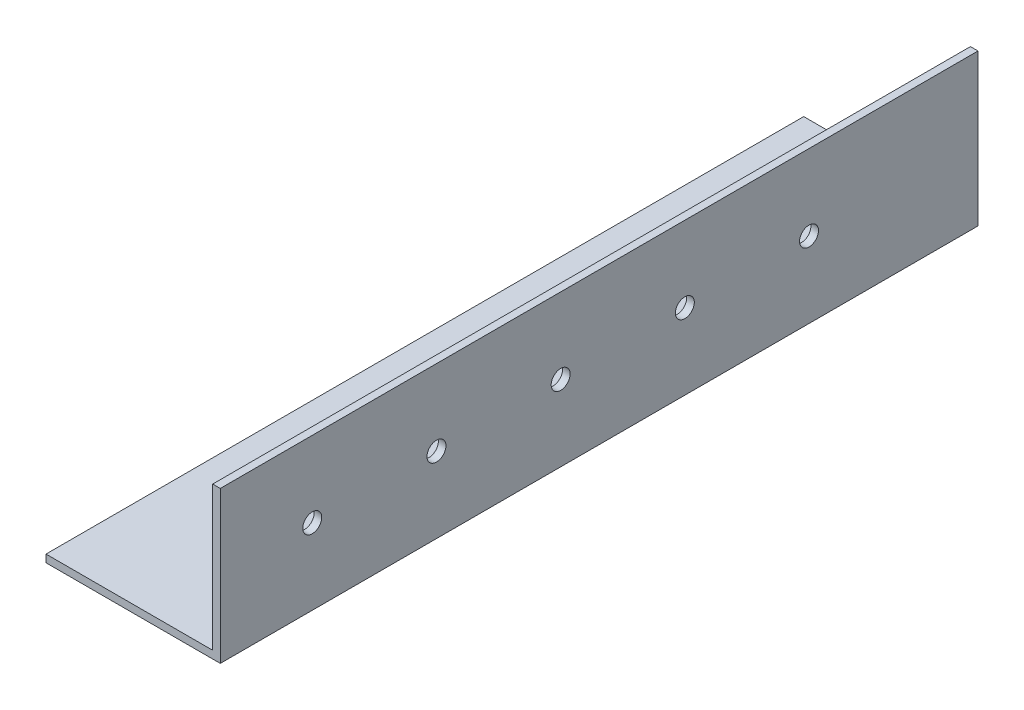
ISO-10303-21;
HEADER;
FILE_DESCRIPTION(('STEP AP214'),'2;1');
FILE_NAME('part.step','',(''),(''),'','','');
FILE_SCHEMA(('AUTOMOTIVE_DESIGN { 1 0 10303 214 1 1 1 1 }'));
ENDSEC;
DATA;
#1=APPLICATION_CONTEXT('core data for automotive mechanical design processes');
#2=APPLICATION_PROTOCOL_DEFINITION('international standard','automotive_design',2000,#1);
#3=PRODUCT_CONTEXT('',#1,'mechanical');
#4=PRODUCT('Part','Part','',(#3));
#5=PRODUCT_RELATED_PRODUCT_CATEGORY('part','',(#4));
#6=PRODUCT_DEFINITION_FORMATION('','',#4);
#7=PRODUCT_DEFINITION_CONTEXT('part definition',#1,'design');
#8=PRODUCT_DEFINITION('design','',#6,#7);
#9=PRODUCT_DEFINITION_SHAPE('','',#8);
#10=(LENGTH_UNIT() NAMED_UNIT(*) SI_UNIT(.MILLI.,.METRE.));
#11=(NAMED_UNIT(*) PLANE_ANGLE_UNIT() SI_UNIT($,.RADIAN.));
#12=(NAMED_UNIT(*) SI_UNIT($,.STERADIAN.) SOLID_ANGLE_UNIT());
#13=UNCERTAINTY_MEASURE_WITH_UNIT(LENGTH_MEASURE(1.E-05),#10,'distance_accuracy_value','');
#14=(GEOMETRIC_REPRESENTATION_CONTEXT(3) GLOBAL_UNCERTAINTY_ASSIGNED_CONTEXT((#13)) GLOBAL_UNIT_ASSIGNED_CONTEXT((#10,
#11,#12)) REPRESENTATION_CONTEXT('',''));
#15=CARTESIAN_POINT('',(0.,0.,0.));
#16=DIRECTION('',(0.,0.,1.));
#17=DIRECTION('',(1.,0.,0.));
#18=AXIS2_PLACEMENT_3D('',#15,#16,#17);
#19=CARTESIAN_POINT('',(0.,0.,100.));
#20=DIRECTION('',(0.,0.,-1.));
#21=DIRECTION('',(1.,0.,0.));
#22=AXIS2_PLACEMENT_3D('',#19,#20,#21);
#23=PLANE('',#22);
#24=DIRECTION('',(1.,0.,0.));
#25=VECTOR('',#24,1.);
#26=CARTESIAN_POINT('',(0.,-20.,100.));
#27=LINE('',#26,#25);
#28=CARTESIAN_POINT('',(-19.,-20.,100.));
#29=VERTEX_POINT('',#28);
#30=CARTESIAN_POINT('',(27.,-20.,100.));
#31=VERTEX_POINT('',#30);
#32=EDGE_CURVE('E110',#29,#31,#27,.T.);
#33=ORIENTED_EDGE('',*,*,#32,.T.);
#34=DIRECTION('',(0.,-1.,0.));
#35=VECTOR('',#34,1.);
#36=CARTESIAN_POINT('',(27.,20.,100.));
#37=LINE('',#36,#35);
#38=CARTESIAN_POINT('',(27.,20.,100.));
#39=VERTEX_POINT('',#38);
#40=EDGE_CURVE('E125',#39,#31,#37,.T.);
#41=ORIENTED_EDGE('',*,*,#40,.F.);
#42=DIRECTION('',(1.,0.,0.));
#43=VECTOR('',#42,1.);
#44=CARTESIAN_POINT('',(25.,20.,100.));
#45=LINE('',#44,#43);
#46=CARTESIAN_POINT('',(25.,20.,100.));
#47=VERTEX_POINT('',#46);
#48=EDGE_CURVE('E132',#47,#39,#45,.T.);
#49=ORIENTED_EDGE('',*,*,#48,.F.);
#50=DIRECTION('',(0.,1.,0.));
#51=VECTOR('',#50,1.);
#52=CARTESIAN_POINT('',(25.,-18.,100.));
#53=LINE('',#52,#51);
#54=CARTESIAN_POINT('',(25.,-18.,100.));
#55=VERTEX_POINT('',#54);
#56=EDGE_CURVE('E130',#55,#47,#53,.T.);
#57=ORIENTED_EDGE('',*,*,#56,.F.);
#58=DIRECTION('',(-1.,0.,0.));
#59=VECTOR('',#58,1.);
#60=CARTESIAN_POINT('',(0.,-18.,100.));
#61=LINE('',#60,#59);
#62=CARTESIAN_POINT('',(-19.,-18.,100.));
#63=VERTEX_POINT('',#62);
#64=EDGE_CURVE('E112',#55,#63,#61,.T.);
#65=ORIENTED_EDGE('',*,*,#64,.T.);
#66=DIRECTION('',(0.,1.,0.));
#67=VECTOR('',#66,1.);
#68=CARTESIAN_POINT('',(-19.,-20.,100.));
#69=LINE('',#68,#67);
#70=EDGE_CURVE('E99',#29,#63,#69,.T.);
#71=ORIENTED_EDGE('',*,*,#70,.F.);
#72=EDGE_LOOP('',(#33,#41,#49,#57,#65,#71));
#73=FACE_BOUND('',#72,.T.);
#74=ADVANCED_FACE('F37',(#73),#23,.F.);
#75=CARTESIAN_POINT('',(0.,-20.,-100.));
#76=DIRECTION('',(0.,1.,0.));
#77=DIRECTION('',(-1.,0.,0.));
#78=AXIS2_PLACEMENT_3D('',#75,#76,#77);
#79=PLANE('',#78);
#80=DIRECTION('',(1.,0.,0.));
#81=VECTOR('',#80,1.);
#82=CARTESIAN_POINT('',(0.,-20.,-100.));
#83=LINE('',#82,#81);
#84=CARTESIAN_POINT('',(-19.,-20.,-100.));
#85=VERTEX_POINT('',#84);
#86=CARTESIAN_POINT('',(27.,-20.,-100.));
#87=VERTEX_POINT('',#86);
#88=EDGE_CURVE('E46',#85,#87,#83,.T.);
#89=ORIENTED_EDGE('',*,*,#88,.T.);
#90=DIRECTION('',(0.,0.,1.));
#91=VECTOR('',#90,1.);
#92=CARTESIAN_POINT('',(27.,-20.,-100.));
#93=LINE('',#92,#91);
#94=EDGE_CURVE('E116',#87,#31,#93,.T.);
#95=ORIENTED_EDGE('',*,*,#94,.T.);
#96=ORIENTED_EDGE('',*,*,#32,.F.);
#97=DIRECTION('',(0.,0.,-1.));
#98=VECTOR('',#97,1.);
#99=CARTESIAN_POINT('',(-19.,-20.,100.));
#100=LINE('',#99,#98);
#101=EDGE_CURVE('E96',#29,#85,#100,.T.);
#102=ORIENTED_EDGE('',*,*,#101,.T.);
#103=EDGE_LOOP('',(#89,#95,#96,#102));
#104=FACE_BOUND('',#103,.T.);
#105=ADVANCED_FACE('F114',(#104),#79,.F.);
#106=CARTESIAN_POINT('',(0.,-18.,-100.));
#107=DIRECTION('',(0.,-1.,0.));
#108=DIRECTION('',(1.,0.,0.));
#109=AXIS2_PLACEMENT_3D('',#106,#107,#108);
#110=PLANE('',#109);
#111=ORIENTED_EDGE('',*,*,#64,.F.);
#112=DIRECTION('',(0.,0.,1.));
#113=VECTOR('',#112,1.);
#114=CARTESIAN_POINT('',(25.,-18.,-100.));
#115=LINE('',#114,#113);
#116=CARTESIAN_POINT('',(25.,-18.,-100.));
#117=VERTEX_POINT('',#116);
#118=EDGE_CURVE('E83',#117,#55,#115,.T.);
#119=ORIENTED_EDGE('',*,*,#118,.F.);
#120=DIRECTION('',(-1.,0.,0.));
#121=VECTOR('',#120,1.);
#122=CARTESIAN_POINT('',(0.,-18.,-100.));
#123=LINE('',#122,#121);
#124=CARTESIAN_POINT('',(-19.,-18.,-100.));
#125=VERTEX_POINT('',#124);
#126=EDGE_CURVE('E11',#117,#125,#123,.T.);
#127=ORIENTED_EDGE('',*,*,#126,.T.);
#128=DIRECTION('',(0.,0.,-1.));
#129=VECTOR('',#128,1.);
#130=CARTESIAN_POINT('',(-19.,-18.,-100.));
#131=LINE('',#130,#129);
#132=EDGE_CURVE('E105',#63,#125,#131,.T.);
#133=ORIENTED_EDGE('',*,*,#132,.F.);
#134=EDGE_LOOP('',(#111,#119,#127,#133));
#135=FACE_BOUND('',#134,.T.);
#136=ADVANCED_FACE('F201',(#135),#110,.F.);
#137=CARTESIAN_POINT('',(0.,0.,-100.));
#138=DIRECTION('',(0.,0.,-1.));
#139=DIRECTION('',(1.,0.,0.));
#140=AXIS2_PLACEMENT_3D('',#137,#138,#139);
#141=PLANE('',#140);
#142=DIRECTION('',(0.,1.,0.));
#143=VECTOR('',#142,1.);
#144=CARTESIAN_POINT('',(-19.,-20.,-100.));
#145=LINE('',#144,#143);
#146=EDGE_CURVE('E54',#85,#125,#145,.T.);
#147=ORIENTED_EDGE('',*,*,#146,.T.);
#148=ORIENTED_EDGE('',*,*,#126,.F.);
#149=DIRECTION('',(0.,1.,0.));
#150=VECTOR('',#149,1.);
#151=CARTESIAN_POINT('',(25.,-18.,-100.));
#152=LINE('',#151,#150);
#153=CARTESIAN_POINT('',(25.,20.,-100.));
#154=VERTEX_POINT('',#153);
#155=EDGE_CURVE('E63',#117,#154,#152,.T.);
#156=ORIENTED_EDGE('',*,*,#155,.T.);
#157=DIRECTION('',(1.,0.,0.));
#158=VECTOR('',#157,1.);
#159=CARTESIAN_POINT('',(25.,20.,-100.));
#160=LINE('',#159,#158);
#161=CARTESIAN_POINT('',(27.,20.,-100.));
#162=VERTEX_POINT('',#161);
#163=EDGE_CURVE('E124',#154,#162,#160,.T.);
#164=ORIENTED_EDGE('',*,*,#163,.T.);
#165=DIRECTION('',(0.,-1.,0.));
#166=VECTOR('',#165,1.);
#167=CARTESIAN_POINT('',(27.,20.,-100.));
#168=LINE('',#167,#166);
#169=EDGE_CURVE('E128',#162,#87,#168,.T.);
#170=ORIENTED_EDGE('',*,*,#169,.T.);
#171=ORIENTED_EDGE('',*,*,#88,.F.);
#172=EDGE_LOOP('',(#147,#148,#156,#164,#170,#171));
#173=FACE_BOUND('',#172,.T.);
#174=ADVANCED_FACE('F180',(#173),#141,.T.);
#175=CARTESIAN_POINT('',(27.,20.,-100.));
#176=DIRECTION('',(1.,0.,0.));
#177=DIRECTION('',(0.,1.,0.));
#178=AXIS2_PLACEMENT_3D('',#175,#176,#177);
#179=PLANE('',#178);
#180=CARTESIAN_POINT('',(27.,0.,-55.4));
#181=DIRECTION('',(-1.,0.,0.));
#182=DIRECTION('',(0.,1.,0.));
#183=AXIS2_PLACEMENT_3D('',#180,#181,#182);
#184=CIRCLE('',#183,2.5);
#185=CARTESIAN_POINT('',(27.,2.5,-55.4));
#186=VERTEX_POINT('',#185);
#187=EDGE_CURVE('E144',#186,#186,#184,.T.);
#188=ORIENTED_EDGE('',*,*,#187,.T.);
#189=EDGE_LOOP('',(#188));
#190=FACE_BOUND('',#189,.T.);
#191=CARTESIAN_POINT('',(27.,0.,-22.62));
#192=DIRECTION('',(-1.,0.,0.));
#193=DIRECTION('',(0.,1.,0.));
#194=AXIS2_PLACEMENT_3D('',#191,#192,#193);
#195=CIRCLE('',#194,2.5);
#196=CARTESIAN_POINT('',(27.,2.5,-22.62));
#197=VERTEX_POINT('',#196);
#198=EDGE_CURVE('E165',#197,#197,#195,.T.);
#199=ORIENTED_EDGE('',*,*,#198,.T.);
#200=EDGE_LOOP('',(#199));
#201=FACE_BOUND('',#200,.T.);
#202=CARTESIAN_POINT('',(27.,0.,10.16));
#203=DIRECTION('',(-1.,0.,0.));
#204=DIRECTION('',(0.,1.,0.));
#205=AXIS2_PLACEMENT_3D('',#202,#203,#204);
#206=CIRCLE('',#205,2.5);
#207=CARTESIAN_POINT('',(27.,2.50000000000001,10.16));
#208=VERTEX_POINT('',#207);
#209=EDGE_CURVE('E168',#208,#208,#206,.T.);
#210=ORIENTED_EDGE('',*,*,#209,.T.);
#211=EDGE_LOOP('',(#210));
#212=FACE_BOUND('',#211,.T.);
#213=CARTESIAN_POINT('',(27.,0.,42.94));
#214=DIRECTION('',(-1.,0.,0.));
#215=DIRECTION('',(0.,1.,0.));
#216=AXIS2_PLACEMENT_3D('',#213,#214,#215);
#217=CIRCLE('',#216,2.5);
#218=CARTESIAN_POINT('',(27.,2.50000000000001,42.94));
#219=VERTEX_POINT('',#218);
#220=EDGE_CURVE('E174',#219,#219,#217,.T.);
#221=ORIENTED_EDGE('',*,*,#220,.T.);
#222=EDGE_LOOP('',(#221));
#223=FACE_BOUND('',#222,.T.);
#224=CARTESIAN_POINT('',(27.,0.,75.72));
#225=DIRECTION('',(-1.,0.,0.));
#226=DIRECTION('',(0.,1.,0.));
#227=AXIS2_PLACEMENT_3D('',#224,#225,#226);
#228=CIRCLE('',#227,2.49999999999999);
#229=CARTESIAN_POINT('',(27.,2.5,75.72));
#230=VERTEX_POINT('',#229);
#231=EDGE_CURVE('E177',#230,#230,#228,.T.);
#232=ORIENTED_EDGE('',*,*,#231,.T.);
#233=EDGE_LOOP('',(#232));
#234=FACE_BOUND('',#233,.T.);
#235=ORIENTED_EDGE('',*,*,#40,.T.);
#236=ORIENTED_EDGE('',*,*,#94,.F.);
#237=ORIENTED_EDGE('',*,*,#169,.F.);
#238=DIRECTION('',(0.,0.,1.));
#239=VECTOR('',#238,1.);
#240=CARTESIAN_POINT('',(27.,20.,-100.));
#241=LINE('',#240,#239);
#242=EDGE_CURVE('E137',#162,#39,#241,.T.);
#243=ORIENTED_EDGE('',*,*,#242,.T.);
#244=EDGE_LOOP('',(#235,#236,#237,#243));
#245=FACE_BOUND('',#244,.T.);
#246=ADVANCED_FACE('F183',(#190,#201,#212,#223,#234,#245),#179,.T.);
#247=CARTESIAN_POINT('',(25.,20.,-100.));
#248=DIRECTION('',(0.,1.,0.));
#249=DIRECTION('',(-1.,0.,0.));
#250=AXIS2_PLACEMENT_3D('',#247,#248,#249);
#251=PLANE('',#250);
#252=ORIENTED_EDGE('',*,*,#48,.T.);
#253=ORIENTED_EDGE('',*,*,#242,.F.);
#254=ORIENTED_EDGE('',*,*,#163,.F.);
#255=DIRECTION('',(0.,0.,1.));
#256=VECTOR('',#255,1.);
#257=CARTESIAN_POINT('',(25.,20.,-100.));
#258=LINE('',#257,#256);
#259=EDGE_CURVE('E86',#154,#47,#258,.T.);
#260=ORIENTED_EDGE('',*,*,#259,.T.);
#261=EDGE_LOOP('',(#252,#253,#254,#260));
#262=FACE_BOUND('',#261,.T.);
#263=ADVANCED_FACE('F186',(#262),#251,.T.);
#264=CARTESIAN_POINT('',(25.,-18.,-100.));
#265=DIRECTION('',(-1.,0.,0.));
#266=DIRECTION('',(0.,-1.,0.));
#267=AXIS2_PLACEMENT_3D('',#264,#265,#266);
#268=PLANE('',#267);
#269=CARTESIAN_POINT('',(25.,0.,-55.4));
#270=DIRECTION('',(1.,0.,0.));
#271=DIRECTION('',(0.,-1.,0.));
#272=AXIS2_PLACEMENT_3D('',#269,#270,#271);
#273=CIRCLE('',#272,2.5);
#274=CARTESIAN_POINT('',(25.,-2.5,-55.4));
#275=VERTEX_POINT('',#274);
#276=EDGE_CURVE('E41',#275,#275,#273,.T.);
#277=ORIENTED_EDGE('',*,*,#276,.T.);
#278=EDGE_LOOP('',(#277));
#279=FACE_BOUND('',#278,.T.);
#280=CARTESIAN_POINT('',(25.,0.,-22.62));
#281=DIRECTION('',(1.,0.,0.));
#282=DIRECTION('',(0.,-1.,0.));
#283=AXIS2_PLACEMENT_3D('',#280,#281,#282);
#284=CIRCLE('',#283,2.5);
#285=CARTESIAN_POINT('',(25.,-2.49999999999999,-22.62));
#286=VERTEX_POINT('',#285);
#287=EDGE_CURVE('E149',#286,#286,#284,.T.);
#288=ORIENTED_EDGE('',*,*,#287,.T.);
#289=EDGE_LOOP('',(#288));
#290=FACE_BOUND('',#289,.T.);
#291=CARTESIAN_POINT('',(25.,0.,10.16));
#292=DIRECTION('',(1.,0.,0.));
#293=DIRECTION('',(0.,-1.,0.));
#294=AXIS2_PLACEMENT_3D('',#291,#292,#293);
#295=CIRCLE('',#294,2.5);
#296=CARTESIAN_POINT('',(25.,-2.49999999999999,10.16));
#297=VERTEX_POINT('',#296);
#298=EDGE_CURVE('E147',#297,#297,#295,.T.);
#299=ORIENTED_EDGE('',*,*,#298,.T.);
#300=EDGE_LOOP('',(#299));
#301=FACE_BOUND('',#300,.T.);
#302=CARTESIAN_POINT('',(25.,0.,42.94));
#303=DIRECTION('',(1.,0.,0.));
#304=DIRECTION('',(0.,-1.,0.));
#305=AXIS2_PLACEMENT_3D('',#302,#303,#304);
#306=CIRCLE('',#305,2.5);
#307=CARTESIAN_POINT('',(25.,-2.5,42.94));
#308=VERTEX_POINT('',#307);
#309=EDGE_CURVE('E143',#308,#308,#306,.T.);
#310=ORIENTED_EDGE('',*,*,#309,.T.);
#311=EDGE_LOOP('',(#310));
#312=FACE_BOUND('',#311,.T.);
#313=CARTESIAN_POINT('',(25.,0.,75.72));
#314=DIRECTION('',(1.,0.,0.));
#315=DIRECTION('',(0.,-1.,0.));
#316=AXIS2_PLACEMENT_3D('',#313,#314,#315);
#317=CIRCLE('',#316,2.49999999999999);
#318=CARTESIAN_POINT('',(25.,-2.49999999999999,75.72));
#319=VERTEX_POINT('',#318);
#320=EDGE_CURVE('E140',#319,#319,#317,.T.);
#321=ORIENTED_EDGE('',*,*,#320,.T.);
#322=EDGE_LOOP('',(#321));
#323=FACE_BOUND('',#322,.T.);
#324=ORIENTED_EDGE('',*,*,#56,.T.);
#325=ORIENTED_EDGE('',*,*,#259,.F.);
#326=ORIENTED_EDGE('',*,*,#155,.F.);
#327=ORIENTED_EDGE('',*,*,#118,.T.);
#328=EDGE_LOOP('',(#324,#325,#326,#327));
#329=FACE_BOUND('',#328,.T.);
#330=ADVANCED_FACE('F39',(#279,#290,#301,#312,#323,#329),#268,.T.);
#331=CARTESIAN_POINT('',(17.,0.,75.72));
#332=DIRECTION('',(1.,0.,0.));
#333=DIRECTION('',(0.,1.,0.));
#334=AXIS2_PLACEMENT_3D('',#331,#332,#333);
#335=CYLINDRICAL_SURFACE('',#334,2.49999999999999);
#336=ORIENTED_EDGE('',*,*,#320,.F.);
#337=EDGE_LOOP('',(#336));
#338=FACE_BOUND('',#337,.T.);
#339=ORIENTED_EDGE('',*,*,#231,.F.);
#340=EDGE_LOOP('',(#339));
#341=FACE_BOUND('',#340,.T.);
#342=ADVANCED_FACE('F188',(#338,#341),#335,.F.);
#343=CARTESIAN_POINT('',(17.,0.,42.94));
#344=DIRECTION('',(1.,0.,0.));
#345=DIRECTION('',(0.,1.,0.));
#346=AXIS2_PLACEMENT_3D('',#343,#344,#345);
#347=CYLINDRICAL_SURFACE('',#346,2.5);
#348=ORIENTED_EDGE('',*,*,#309,.F.);
#349=EDGE_LOOP('',(#348));
#350=FACE_BOUND('',#349,.T.);
#351=ORIENTED_EDGE('',*,*,#220,.F.);
#352=EDGE_LOOP('',(#351));
#353=FACE_BOUND('',#352,.T.);
#354=ADVANCED_FACE('F193',(#350,#353),#347,.F.);
#355=CARTESIAN_POINT('',(17.,0.,10.16));
#356=DIRECTION('',(1.,0.,0.));
#357=DIRECTION('',(0.,1.,0.));
#358=AXIS2_PLACEMENT_3D('',#355,#356,#357);
#359=CYLINDRICAL_SURFACE('',#358,2.5);
#360=ORIENTED_EDGE('',*,*,#298,.F.);
#361=EDGE_LOOP('',(#360));
#362=FACE_BOUND('',#361,.T.);
#363=ORIENTED_EDGE('',*,*,#209,.F.);
#364=EDGE_LOOP('',(#363));
#365=FACE_BOUND('',#364,.T.);
#366=ADVANCED_FACE('F223',(#362,#365),#359,.F.);
#367=CARTESIAN_POINT('',(17.,0.,-22.62));
#368=DIRECTION('',(1.,0.,0.));
#369=DIRECTION('',(0.,1.,0.));
#370=AXIS2_PLACEMENT_3D('',#367,#368,#369);
#371=CYLINDRICAL_SURFACE('',#370,2.5);
#372=ORIENTED_EDGE('',*,*,#287,.F.);
#373=EDGE_LOOP('',(#372));
#374=FACE_BOUND('',#373,.T.);
#375=ORIENTED_EDGE('',*,*,#198,.F.);
#376=EDGE_LOOP('',(#375));
#377=FACE_BOUND('',#376,.T.);
#378=ADVANCED_FACE('F160',(#374,#377),#371,.F.);
#379=CARTESIAN_POINT('',(17.,0.,-55.4));
#380=DIRECTION('',(1.,0.,0.));
#381=DIRECTION('',(0.,1.,0.));
#382=AXIS2_PLACEMENT_3D('',#379,#380,#381);
#383=CYLINDRICAL_SURFACE('',#382,2.5);
#384=ORIENTED_EDGE('',*,*,#276,.F.);
#385=EDGE_LOOP('',(#384));
#386=FACE_BOUND('',#385,.T.);
#387=ORIENTED_EDGE('',*,*,#187,.F.);
#388=EDGE_LOOP('',(#387));
#389=FACE_BOUND('',#388,.T.);
#390=ADVANCED_FACE('F157',(#386,#389),#383,.F.);
#391=CARTESIAN_POINT('',(-19.,-20.,100.));
#392=DIRECTION('',(1.,0.,0.));
#393=DIRECTION('',(0.,0.,1.));
#394=AXIS2_PLACEMENT_3D('',#391,#392,#393);
#395=PLANE('',#394);
#396=ORIENTED_EDGE('',*,*,#70,.T.);
#397=ORIENTED_EDGE('',*,*,#132,.T.);
#398=ORIENTED_EDGE('',*,*,#146,.F.);
#399=ORIENTED_EDGE('',*,*,#101,.F.);
#400=EDGE_LOOP('',(#396,#397,#398,#399));
#401=FACE_BOUND('',#400,.T.);
#402=ADVANCED_FACE('F98',(#401),#395,.F.);
#403=CLOSED_SHELL('',(#74,#105,#136,#174,#246,#263,#330,#342,#354,#366,#378,#390,#402));
#404=MANIFOLD_SOLID_BREP('B2',#403);
#405=ADVANCED_BREP_SHAPE_REPRESENTATION('',(#18,#404),#14);
#406=SHAPE_DEFINITION_REPRESENTATION(#9,#405);
ENDSEC;
END-ISO-10303-21;
